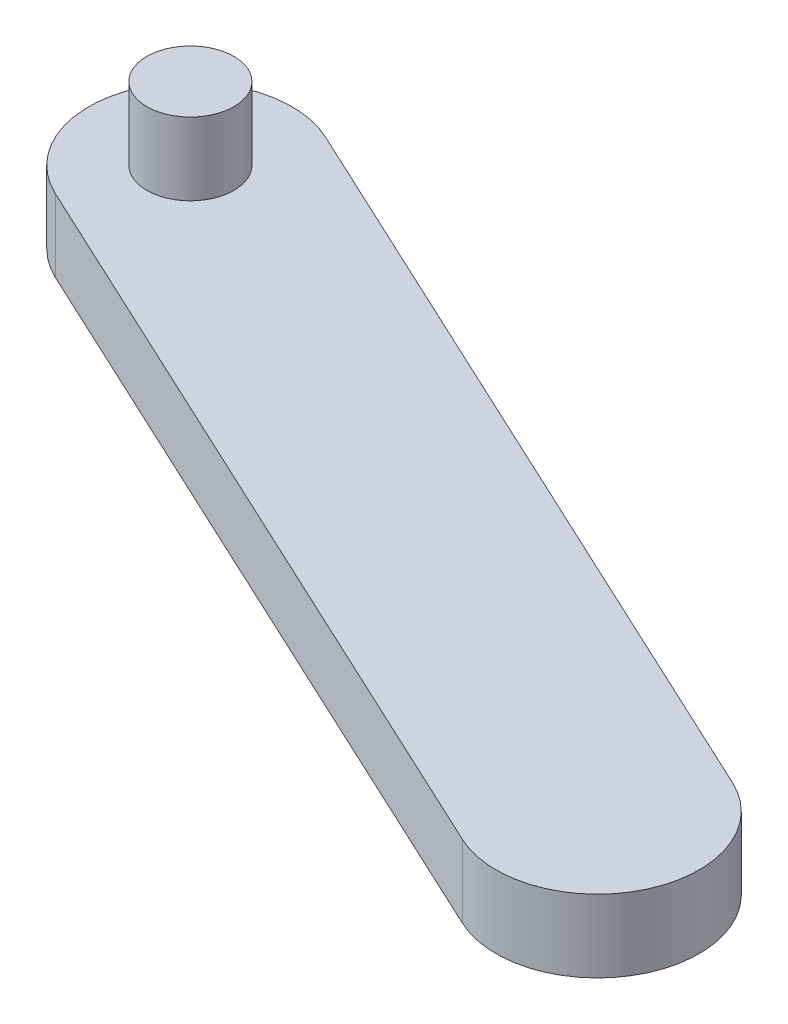
ISO-10303-21;
HEADER;
FILE_DESCRIPTION(('STEP AP214'),'2;1');
FILE_NAME('part.step','',(''),(''),'','','');
FILE_SCHEMA(('AUTOMOTIVE_DESIGN { 1 0 10303 214 1 1 1 1 }'));
ENDSEC;
DATA;
#1=APPLICATION_CONTEXT('core data for automotive mechanical design processes');
#2=APPLICATION_PROTOCOL_DEFINITION('international standard','automotive_design',2000,#1);
#3=PRODUCT_CONTEXT('',#1,'mechanical');
#4=PRODUCT('Part','Part','',(#3));
#5=PRODUCT_RELATED_PRODUCT_CATEGORY('part','',(#4));
#6=PRODUCT_DEFINITION_FORMATION('','',#4);
#7=PRODUCT_DEFINITION_CONTEXT('part definition',#1,'design');
#8=PRODUCT_DEFINITION('design','',#6,#7);
#9=PRODUCT_DEFINITION_SHAPE('','',#8);
#10=(LENGTH_UNIT() NAMED_UNIT(*) SI_UNIT(.MILLI.,.METRE.));
#11=(NAMED_UNIT(*) PLANE_ANGLE_UNIT() SI_UNIT($,.RADIAN.));
#12=(NAMED_UNIT(*) SI_UNIT($,.STERADIAN.) SOLID_ANGLE_UNIT());
#13=UNCERTAINTY_MEASURE_WITH_UNIT(LENGTH_MEASURE(1.E-05),#10,'distance_accuracy_value','');
#14=(GEOMETRIC_REPRESENTATION_CONTEXT(3) GLOBAL_UNCERTAINTY_ASSIGNED_CONTEXT((#13)) GLOBAL_UNIT_ASSIGNED_CONTEXT((#10,
#11,#12)) REPRESENTATION_CONTEXT('',''));
#15=CARTESIAN_POINT('',(0.,0.,0.));
#16=DIRECTION('',(0.,0.,1.));
#17=DIRECTION('',(1.,0.,0.));
#18=AXIS2_PLACEMENT_3D('',#15,#16,#17);
#19=CARTESIAN_POINT('',(556.901560726433,165.,280.835669279043));
#20=DIRECTION('',(0.,-1.,0.));
#21=DIRECTION('',(0.,0.,-1.));
#22=AXIS2_PLACEMENT_3D('',#19,#20,#21);
#23=PLANE('',#22);
#24=CARTESIAN_POINT('',(425.486931606119,165.,219.556021326642));
#25=DIRECTION('',(0.,-1.,0.));
#26=DIRECTION('',(1.,0.,0.));
#27=AXIS2_PLACEMENT_3D('',#24,#25,#26);
#28=CIRCLE('',#27,15.);
#29=CARTESIAN_POINT('',(410.486931606119,165.,219.556021326642));
#30=VERTEX_POINT('',#29);
#31=EDGE_CURVE('E118',#30,#30,#28,.T.);
#32=ORIENTED_EDGE('',*,*,#31,.F.);
#33=EDGE_LOOP('',(#32));
#34=FACE_BOUND('',#33,.T.);
#35=DIRECTION('',(0.90630778703665,0.,0.422618261740699));
#36=VECTOR('',#35,1.);
#37=CARTESIAN_POINT('',(607.817236125666,165.,343.196265801526));
#38=LINE('',#37,#36);
#39=CARTESIAN_POINT('',(410.695292445195,165.,251.276793872924));
#40=VERTEX_POINT('',#39);
#41=CARTESIAN_POINT('',(673.524550685823,165.,373.836089777727));
#42=VERTEX_POINT('',#41);
#43=EDGE_CURVE('E28',#40,#42,#38,.T.);
#44=ORIENTED_EDGE('',*,*,#43,.F.);
#45=CARTESIAN_POINT('',(425.486931606119,165.,219.556021326642));
#46=DIRECTION('',(0.,1.,0.));
#47=DIRECTION('',(-0.422618261740698,0.,0.906307787036651));
#48=AXIS2_PLACEMENT_3D('',#45,#46,#47);
#49=CIRCLE('',#48,35.);
#50=CARTESIAN_POINT('',(440.278570767043,165.,187.835248780359));
#51=VERTEX_POINT('',#50);
#52=EDGE_CURVE('E62',#51,#40,#49,.T.);
#53=ORIENTED_EDGE('',*,*,#52,.F.);
#54=DIRECTION('',(-0.906307787036651,0.,-0.422618261740698));
#55=VECTOR('',#54,1.);
#56=CARTESIAN_POINT('',(505.985885327201,165.,218.475072756559));
#57=LINE('',#56,#55);
#58=CARTESIAN_POINT('',(703.107829007672,165.,310.394544685161));
#59=VERTEX_POINT('',#58);
#60=EDGE_CURVE('E135',#59,#51,#57,.T.);
#61=ORIENTED_EDGE('',*,*,#60,.F.);
#62=CARTESIAN_POINT('',(688.316189846748,165.,342.115317231444));
#63=DIRECTION('',(0.,1.,0.));
#64=DIRECTION('',(0.422618261740702,0.,-0.906307787036649));
#65=AXIS2_PLACEMENT_3D('',#62,#63,#64);
#66=CIRCLE('',#65,35.);
#67=EDGE_CURVE('E122',#42,#59,#66,.T.);
#68=ORIENTED_EDGE('',*,*,#67,.F.);
#69=EDGE_LOOP('',(#44,#53,#61,#68));
#70=FACE_BOUND('',#69,.T.);
#71=ADVANCED_FACE('F17',(#34,#70),#23,.T.);
#72=CARTESIAN_POINT('',(556.901560726433,190.,280.835669279043));
#73=DIRECTION('',(0.,-1.,0.));
#74=DIRECTION('',(0.,0.,-1.));
#75=AXIS2_PLACEMENT_3D('',#72,#73,#74);
#76=PLANE('',#75);
#77=CARTESIAN_POINT('',(425.486931606119,190.,219.556021326642));
#78=DIRECTION('',(0.,1.,0.));
#79=DIRECTION('',(1.,0.,0.));
#80=AXIS2_PLACEMENT_3D('',#77,#78,#79);
#81=CIRCLE('',#80,15.);
#82=CARTESIAN_POINT('',(410.486931606119,190.,219.556021326642));
#83=VERTEX_POINT('',#82);
#84=EDGE_CURVE('E92',#83,#83,#81,.T.);
#85=ORIENTED_EDGE('',*,*,#84,.F.);
#86=EDGE_LOOP('',(#85));
#87=FACE_BOUND('',#86,.T.);
#88=DIRECTION('',(-0.90630778703665,0.,-0.422618261740699));
#89=VECTOR('',#88,1.);
#90=CARTESIAN_POINT('',(607.817236125666,190.,343.196265801526));
#91=LINE('',#90,#89);
#92=CARTESIAN_POINT('',(673.524550685823,190.,373.836089777727));
#93=VERTEX_POINT('',#92);
#94=CARTESIAN_POINT('',(410.695292445195,190.,251.276793872924));
#95=VERTEX_POINT('',#94);
#96=EDGE_CURVE('E11',#93,#95,#91,.T.);
#97=ORIENTED_EDGE('',*,*,#96,.F.);
#98=CARTESIAN_POINT('',(688.316189846748,190.,342.115317231444));
#99=DIRECTION('',(0.,-1.,0.));
#100=DIRECTION('',(0.422618261740702,0.,-0.906307787036649));
#101=AXIS2_PLACEMENT_3D('',#98,#99,#100);
#102=CIRCLE('',#101,35.);
#103=CARTESIAN_POINT('',(703.107829007672,190.,310.394544685161));
#104=VERTEX_POINT('',#103);
#105=EDGE_CURVE('E148',#104,#93,#102,.T.);
#106=ORIENTED_EDGE('',*,*,#105,.F.);
#107=DIRECTION('',(0.906307787036651,0.,0.422618261740698));
#108=VECTOR('',#107,1.);
#109=CARTESIAN_POINT('',(505.985885327201,190.,218.475072756559));
#110=LINE('',#109,#108);
#111=CARTESIAN_POINT('',(440.278570767043,190.,187.835248780359));
#112=VERTEX_POINT('',#111);
#113=EDGE_CURVE('E124',#112,#104,#110,.T.);
#114=ORIENTED_EDGE('',*,*,#113,.F.);
#115=CARTESIAN_POINT('',(425.486931606119,190.,219.556021326642));
#116=DIRECTION('',(0.,-1.,0.));
#117=DIRECTION('',(-0.422618261740698,0.,0.906307787036651));
#118=AXIS2_PLACEMENT_3D('',#115,#116,#117);
#119=CIRCLE('',#118,35.);
#120=EDGE_CURVE('E127',#95,#112,#119,.T.);
#121=ORIENTED_EDGE('',*,*,#120,.F.);
#122=EDGE_LOOP('',(#97,#106,#114,#121));
#123=FACE_BOUND('',#122,.T.);
#124=ADVANCED_FACE('F170',(#87,#123),#76,.F.);
#125=CARTESIAN_POINT('',(673.524550685823,165.,373.836089777727));
#126=DIRECTION('',(0.422618261740699,0.,-0.90630778703665));
#127=DIRECTION('',(0.,-1.,0.));
#128=AXIS2_PLACEMENT_3D('',#125,#126,#127);
#129=PLANE('',#128);
#130=ORIENTED_EDGE('',*,*,#43,.T.);
#131=DIRECTION('',(0.,1.,0.));
#132=VECTOR('',#131,1.);
#133=CARTESIAN_POINT('',(673.524550685823,165.,373.836089777727));
#134=LINE('',#133,#132);
#135=EDGE_CURVE('E151',#42,#93,#134,.T.);
#136=ORIENTED_EDGE('',*,*,#135,.T.);
#137=ORIENTED_EDGE('',*,*,#96,.T.);
#138=DIRECTION('',(0.,1.,0.));
#139=VECTOR('',#138,1.);
#140=CARTESIAN_POINT('',(410.695292445195,165.,251.276793872924));
#141=LINE('',#140,#139);
#142=EDGE_CURVE('E130',#40,#95,#141,.T.);
#143=ORIENTED_EDGE('',*,*,#142,.F.);
#144=EDGE_LOOP('',(#130,#136,#137,#143));
#145=FACE_BOUND('',#144,.T.);
#146=ADVANCED_FACE('F19',(#145),#129,.F.);
#147=CARTESIAN_POINT('',(425.486931606119,165.,219.556021326642));
#148=DIRECTION('',(0.,-1.,0.));
#149=DIRECTION('',(-0.422618261740698,0.,0.906307787036651));
#150=AXIS2_PLACEMENT_3D('',#147,#148,#149);
#151=CYLINDRICAL_SURFACE('',#150,35.);
#152=ORIENTED_EDGE('',*,*,#52,.T.);
#153=ORIENTED_EDGE('',*,*,#142,.T.);
#154=ORIENTED_EDGE('',*,*,#120,.T.);
#155=DIRECTION('',(0.,1.,0.));
#156=VECTOR('',#155,1.);
#157=CARTESIAN_POINT('',(440.278570767043,165.,187.835248780359));
#158=LINE('',#157,#156);
#159=EDGE_CURVE('E125',#51,#112,#158,.T.);
#160=ORIENTED_EDGE('',*,*,#159,.F.);
#161=EDGE_LOOP('',(#152,#153,#154,#160));
#162=FACE_BOUND('',#161,.T.);
#163=ADVANCED_FACE('F175',(#162),#151,.T.);
#164=CARTESIAN_POINT('',(440.278570767043,165.,187.835248780359));
#165=DIRECTION('',(-0.422618261740698,0.,0.906307787036651));
#166=DIRECTION('',(0.,1.,0.));
#167=AXIS2_PLACEMENT_3D('',#164,#165,#166);
#168=PLANE('',#167);
#169=ORIENTED_EDGE('',*,*,#60,.T.);
#170=ORIENTED_EDGE('',*,*,#159,.T.);
#171=ORIENTED_EDGE('',*,*,#113,.T.);
#172=DIRECTION('',(0.,1.,0.));
#173=VECTOR('',#172,1.);
#174=CARTESIAN_POINT('',(703.107829007672,165.,310.394544685161));
#175=LINE('',#174,#173);
#176=EDGE_CURVE('E146',#59,#104,#175,.T.);
#177=ORIENTED_EDGE('',*,*,#176,.F.);
#178=EDGE_LOOP('',(#169,#170,#171,#177));
#179=FACE_BOUND('',#178,.T.);
#180=ADVANCED_FACE('F181',(#179),#168,.F.);
#181=CARTESIAN_POINT('',(688.316189846748,165.,342.115317231444));
#182=DIRECTION('',(0.,-1.,0.));
#183=DIRECTION('',(0.422618261740702,0.,-0.906307787036649));
#184=AXIS2_PLACEMENT_3D('',#181,#182,#183);
#185=CYLINDRICAL_SURFACE('',#184,35.);
#186=ORIENTED_EDGE('',*,*,#67,.T.);
#187=ORIENTED_EDGE('',*,*,#176,.T.);
#188=ORIENTED_EDGE('',*,*,#105,.T.);
#189=ORIENTED_EDGE('',*,*,#135,.F.);
#190=EDGE_LOOP('',(#186,#187,#188,#189));
#191=FACE_BOUND('',#190,.T.);
#192=ADVANCED_FACE('F195',(#191),#185,.T.);
#193=CARTESIAN_POINT('',(425.486931606119,215.,219.556021326642));
#194=DIRECTION('',(0.,-1.,0.));
#195=DIRECTION('',(0.,0.,-1.));
#196=AXIS2_PLACEMENT_3D('',#193,#194,#195);
#197=PLANE('',#196);
#198=CARTESIAN_POINT('',(425.486931606119,215.,219.556021326642));
#199=DIRECTION('',(0.,1.,0.));
#200=DIRECTION('',(1.,0.,0.));
#201=AXIS2_PLACEMENT_3D('',#198,#199,#200);
#202=CIRCLE('',#201,15.);
#203=CARTESIAN_POINT('',(410.486931606119,215.,219.556021326642));
#204=VERTEX_POINT('',#203);
#205=EDGE_CURVE('E21',#204,#204,#202,.T.);
#206=ORIENTED_EDGE('',*,*,#205,.T.);
#207=EDGE_LOOP('',(#206));
#208=FACE_BOUND('',#207,.T.);
#209=ADVANCED_FACE('F102',(#208),#197,.F.);
#210=CARTESIAN_POINT('',(425.486931606119,140.,219.556021326642));
#211=DIRECTION('',(0.,1.,0.));
#212=DIRECTION('',(1.,0.,0.));
#213=AXIS2_PLACEMENT_3D('',#210,#211,#212);
#214=PLANE('',#213);
#215=CARTESIAN_POINT('',(425.486931606119,140.,219.556021326642));
#216=DIRECTION('',(0.,-1.,0.));
#217=DIRECTION('',(1.,0.,0.));
#218=AXIS2_PLACEMENT_3D('',#215,#216,#217);
#219=CIRCLE('',#218,15.);
#220=CARTESIAN_POINT('',(410.486931606119,140.,219.556021326642));
#221=VERTEX_POINT('',#220);
#222=EDGE_CURVE('E104',#221,#221,#219,.T.);
#223=ORIENTED_EDGE('',*,*,#222,.T.);
#224=EDGE_LOOP('',(#223));
#225=FACE_BOUND('',#224,.T.);
#226=ADVANCED_FACE('F192',(#225),#214,.F.);
#227=CARTESIAN_POINT('',(425.486931606119,140.,219.556021326642));
#228=DIRECTION('',(0.,-1.,0.));
#229=DIRECTION('',(1.,0.,0.));
#230=AXIS2_PLACEMENT_3D('',#227,#228,#229);
#231=CYLINDRICAL_SURFACE('',#230,15.);
#232=ORIENTED_EDGE('',*,*,#205,.F.);
#233=DIRECTION('',(0.,-1.,0.));
#234=VECTOR('',#233,1.);
#235=CARTESIAN_POINT('',(410.486931606119,140.,219.556021326642));
#236=LINE('',#235,#234);
#237=EDGE_CURVE('E96',#204,#83,#236,.T.);
#238=ORIENTED_EDGE('',*,*,#237,.T.);
#239=ORIENTED_EDGE('',*,*,#84,.T.);
#240=ORIENTED_EDGE('',*,*,#237,.F.);
#241=EDGE_LOOP('',(#232,#238,#239,#240));
#242=FACE_BOUND('',#241,.T.);
#243=ADVANCED_FACE('F98',(#242),#231,.T.);
#244=CARTESIAN_POINT('',(425.486931606119,140.,219.556021326642));
#245=DIRECTION('',(0.,-1.,0.));
#246=DIRECTION('',(1.,0.,0.));
#247=AXIS2_PLACEMENT_3D('',#244,#245,#246);
#248=CYLINDRICAL_SURFACE('',#247,15.);
#249=ORIENTED_EDGE('',*,*,#31,.T.);
#250=DIRECTION('',(0.,-1.,0.));
#251=VECTOR('',#250,1.);
#252=CARTESIAN_POINT('',(410.486931606119,140.,219.556021326642));
#253=LINE('',#252,#251);
#254=EDGE_CURVE('E109',#30,#221,#253,.T.);
#255=ORIENTED_EDGE('',*,*,#254,.T.);
#256=ORIENTED_EDGE('',*,*,#222,.F.);
#257=ORIENTED_EDGE('',*,*,#254,.F.);
#258=EDGE_LOOP('',(#249,#255,#256,#257));
#259=FACE_BOUND('',#258,.T.);
#260=ADVANCED_FACE('F167',(#259),#248,.T.);
#261=CLOSED_SHELL('',(#71,#124,#146,#163,#180,#192,#209,#226,#243,#260));
#262=MANIFOLD_SOLID_BREP('B1',#261);
#263=ADVANCED_BREP_SHAPE_REPRESENTATION('',(#18,#262),#14);
#264=SHAPE_DEFINITION_REPRESENTATION(#9,#263);
ENDSEC;
END-ISO-10303-21;
